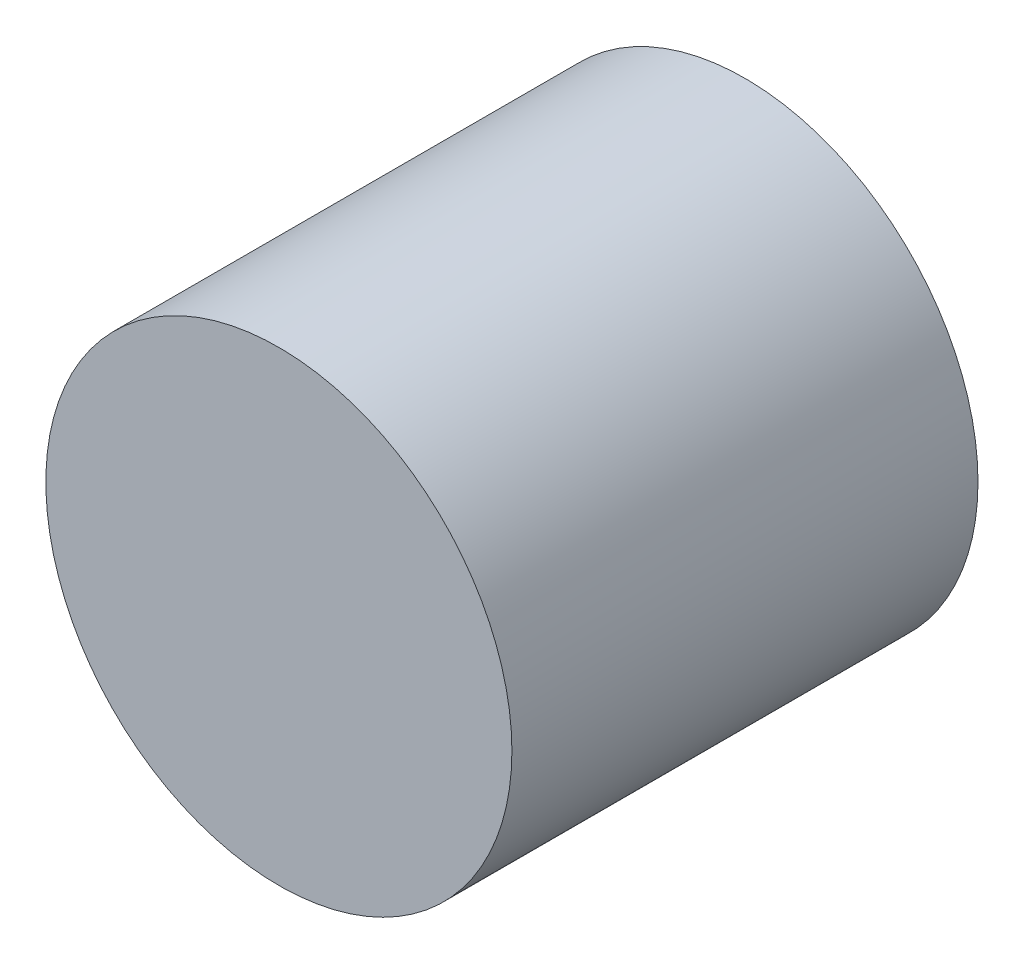
ISO-10303-21;
HEADER;
FILE_DESCRIPTION(('STEP AP214'),'2;1');
FILE_NAME('part.step','',(''),(''),'','','');
FILE_SCHEMA(('AUTOMOTIVE_DESIGN { 1 0 10303 214 1 1 1 1 }'));
ENDSEC;
DATA;
#1=APPLICATION_CONTEXT('core data for automotive mechanical design processes');
#2=APPLICATION_PROTOCOL_DEFINITION('international standard','automotive_design',2000,#1);
#3=PRODUCT_CONTEXT('',#1,'mechanical');
#4=PRODUCT('Part','Part','',(#3));
#5=PRODUCT_RELATED_PRODUCT_CATEGORY('part','',(#4));
#6=PRODUCT_DEFINITION_FORMATION('','',#4);
#7=PRODUCT_DEFINITION_CONTEXT('part definition',#1,'design');
#8=PRODUCT_DEFINITION('design','',#6,#7);
#9=PRODUCT_DEFINITION_SHAPE('','',#8);
#10=(LENGTH_UNIT() NAMED_UNIT(*) SI_UNIT(.MILLI.,.METRE.));
#11=(NAMED_UNIT(*) PLANE_ANGLE_UNIT() SI_UNIT($,.RADIAN.));
#12=(NAMED_UNIT(*) SI_UNIT($,.STERADIAN.) SOLID_ANGLE_UNIT());
#13=UNCERTAINTY_MEASURE_WITH_UNIT(LENGTH_MEASURE(1.E-05),#10,'distance_accuracy_value','');
#14=(GEOMETRIC_REPRESENTATION_CONTEXT(3) GLOBAL_UNCERTAINTY_ASSIGNED_CONTEXT((#13)) GLOBAL_UNIT_ASSIGNED_CONTEXT((#10,
#11,#12)) REPRESENTATION_CONTEXT('',''));
#15=CARTESIAN_POINT('',(0.,0.,0.));
#16=DIRECTION('',(0.,0.,1.));
#17=DIRECTION('',(1.,0.,0.));
#18=AXIS2_PLACEMENT_3D('',#15,#16,#17);
#19=CARTESIAN_POINT('',(0.,0.,17.));
#20=DIRECTION('',(0.,0.,-1.));
#21=DIRECTION('',(-1.,0.,0.));
#22=AXIS2_PLACEMENT_3D('',#19,#20,#21);
#23=CYLINDRICAL_SURFACE('',#22,8.5);
#24=CARTESIAN_POINT('',(0.,0.,17.));
#25=DIRECTION('',(0.,0.,1.));
#26=DIRECTION('',(1.,0.,0.));
#27=AXIS2_PLACEMENT_3D('',#24,#25,#26);
#28=CIRCLE('',#27,8.5);
#29=CARTESIAN_POINT('',(8.5,0.,17.));
#30=VERTEX_POINT('',#29);
#31=EDGE_CURVE('E10',#30,#30,#28,.T.);
#32=ORIENTED_EDGE('',*,*,#31,.F.);
#33=EDGE_LOOP('',(#32));
#34=FACE_BOUND('',#33,.T.);
#35=CARTESIAN_POINT('',(0.,0.,0.));
#36=DIRECTION('',(0.,0.,1.));
#37=DIRECTION('',(1.,0.,0.));
#38=AXIS2_PLACEMENT_3D('',#35,#36,#37);
#39=CIRCLE('',#38,8.5);
#40=CARTESIAN_POINT('',(8.5,0.,0.));
#41=VERTEX_POINT('',#40);
#42=EDGE_CURVE('E33',#41,#41,#39,.T.);
#43=ORIENTED_EDGE('',*,*,#42,.T.);
#44=EDGE_LOOP('',(#43));
#45=FACE_BOUND('',#44,.T.);
#46=ADVANCED_FACE('F30',(#34,#45),#23,.T.);
#47=CARTESIAN_POINT('',(0.,0.,17.));
#48=DIRECTION('',(0.,0.,1.));
#49=DIRECTION('',(1.,0.,0.));
#50=AXIS2_PLACEMENT_3D('',#47,#48,#49);
#51=PLANE('',#50);
#52=ORIENTED_EDGE('',*,*,#31,.T.);
#53=EDGE_LOOP('',(#52));
#54=FACE_BOUND('',#53,.T.);
#55=ADVANCED_FACE('F45',(#54),#51,.T.);
#56=CARTESIAN_POINT('',(0.,0.,0.));
#57=DIRECTION('',(0.,0.,1.));
#58=DIRECTION('',(1.,0.,0.));
#59=AXIS2_PLACEMENT_3D('',#56,#57,#58);
#60=PLANE('',#59);
#61=ORIENTED_EDGE('',*,*,#42,.F.);
#62=EDGE_LOOP('',(#61));
#63=FACE_BOUND('',#62,.T.);
#64=ADVANCED_FACE('F43',(#63),#60,.F.);
#65=CLOSED_SHELL('',(#46,#55,#64));
#66=MANIFOLD_SOLID_BREP('B2',#65);
#67=ADVANCED_BREP_SHAPE_REPRESENTATION('',(#18,#66),#14);
#68=SHAPE_DEFINITION_REPRESENTATION(#9,#67);
ENDSEC;
END-ISO-10303-21;
